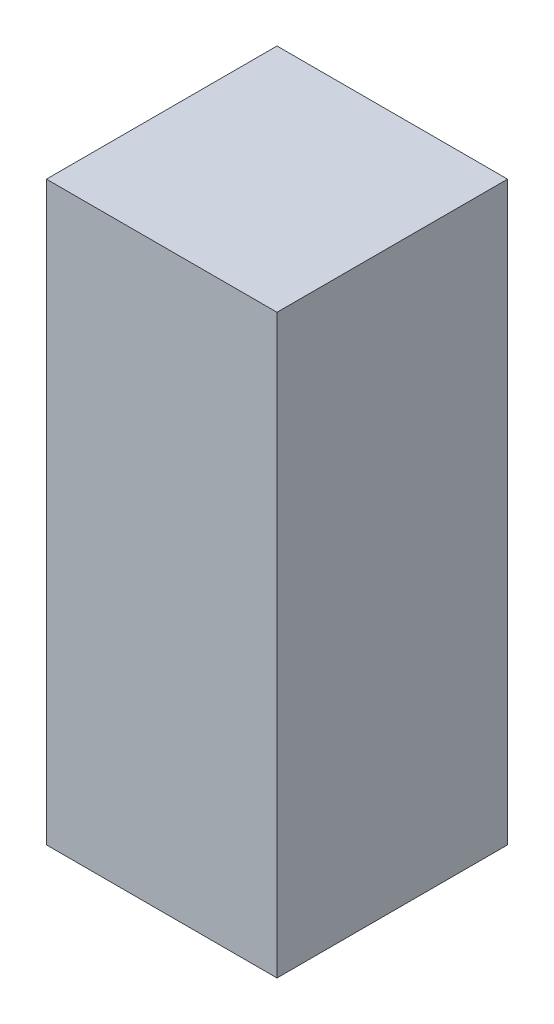
ISO-10303-21;
HEADER;
FILE_DESCRIPTION(('STEP AP214'),'2;1');
FILE_NAME('part.step','',(''),(''),'','','');
FILE_SCHEMA(('AUTOMOTIVE_DESIGN { 1 0 10303 214 1 1 1 1 }'));
ENDSEC;
DATA;
#1=APPLICATION_CONTEXT('core data for automotive mechanical design processes');
#2=APPLICATION_PROTOCOL_DEFINITION('international standard','automotive_design',2000,#1);
#3=PRODUCT_CONTEXT('',#1,'mechanical');
#4=PRODUCT('Part','Part','',(#3));
#5=PRODUCT_RELATED_PRODUCT_CATEGORY('part','',(#4));
#6=PRODUCT_DEFINITION_FORMATION('','',#4);
#7=PRODUCT_DEFINITION_CONTEXT('part definition',#1,'design');
#8=PRODUCT_DEFINITION('design','',#6,#7);
#9=PRODUCT_DEFINITION_SHAPE('','',#8);
#10=(LENGTH_UNIT() NAMED_UNIT(*) SI_UNIT(.MILLI.,.METRE.));
#11=(NAMED_UNIT(*) PLANE_ANGLE_UNIT() SI_UNIT($,.RADIAN.));
#12=(NAMED_UNIT(*) SI_UNIT($,.STERADIAN.) SOLID_ANGLE_UNIT());
#13=UNCERTAINTY_MEASURE_WITH_UNIT(LENGTH_MEASURE(1.E-05),#10,'distance_accuracy_value','');
#14=(GEOMETRIC_REPRESENTATION_CONTEXT(3) GLOBAL_UNCERTAINTY_ASSIGNED_CONTEXT((#13)) GLOBAL_UNIT_ASSIGNED_CONTEXT((#10,
#11,#12)) REPRESENTATION_CONTEXT('',''));
#15=CARTESIAN_POINT('',(0.,0.,0.));
#16=DIRECTION('',(0.,0.,1.));
#17=DIRECTION('',(1.,0.,0.));
#18=AXIS2_PLACEMENT_3D('',#15,#16,#17);
#19=CARTESIAN_POINT('',(0.2499995,0.6250559,0.));
#20=DIRECTION('',(1.,0.,0.));
#21=DIRECTION('',(0.,0.,-1.));
#22=AXIS2_PLACEMENT_3D('',#19,#20,#21);
#23=PLANE('',#22);
#24=DIRECTION('',(0.,0.,-1.));
#25=VECTOR('',#24,1.);
#26=CARTESIAN_POINT('',(0.2499995,-0.62505336,0.));
#27=LINE('',#26,#25);
#28=CARTESIAN_POINT('',(0.2499995,-0.62505336,0.));
#29=VERTEX_POINT('',#28);
#30=CARTESIAN_POINT('',(0.2499995,-0.62505336,0.499999));
#31=VERTEX_POINT('',#30);
#32=EDGE_CURVE('E20',#29,#31,#27,.F.);
#33=ORIENTED_EDGE('',*,*,#32,.F.);
#34=DIRECTION('',(0.,1.,0.));
#35=VECTOR('',#34,1.);
#36=CARTESIAN_POINT('',(0.2499995,-0.62505336,0.));
#37=LINE('',#36,#35);
#38=CARTESIAN_POINT('',(0.2499995,0.6250559,0.));
#39=VERTEX_POINT('',#38);
#40=EDGE_CURVE('E79',#29,#39,#37,.T.);
#41=ORIENTED_EDGE('',*,*,#40,.T.);
#42=DIRECTION('',(0.,0.,1.));
#43=VECTOR('',#42,1.);
#44=CARTESIAN_POINT('',(0.2499995,0.6250559,0.));
#45=LINE('',#44,#43);
#46=CARTESIAN_POINT('',(0.2499995,0.6250559,0.499999));
#47=VERTEX_POINT('',#46);
#48=EDGE_CURVE('E61',#47,#39,#45,.F.);
#49=ORIENTED_EDGE('',*,*,#48,.F.);
#50=DIRECTION('',(0.,1.,0.));
#51=VECTOR('',#50,1.);
#52=CARTESIAN_POINT('',(0.2499995,-0.62505336,0.499999));
#53=LINE('',#52,#51);
#54=EDGE_CURVE('E56',#31,#47,#53,.T.);
#55=ORIENTED_EDGE('',*,*,#54,.F.);
#56=EDGE_LOOP('',(#33,#41,#49,#55));
#57=FACE_BOUND('',#56,.T.);
#58=ADVANCED_FACE('F17',(#57),#23,.T.);
#59=CARTESIAN_POINT('',(0.2499995,-0.62505336,0.));
#60=DIRECTION('',(0.,-1.,0.));
#61=DIRECTION('',(0.,0.,-1.));
#62=AXIS2_PLACEMENT_3D('',#59,#60,#61);
#63=PLANE('',#62);
#64=DIRECTION('',(0.,0.,1.));
#65=VECTOR('',#64,1.);
#66=CARTESIAN_POINT('',(-0.2499995,-0.62505336,0.));
#67=LINE('',#66,#65);
#68=CARTESIAN_POINT('',(-0.2499995,-0.62505336,0.));
#69=VERTEX_POINT('',#68);
#70=CARTESIAN_POINT('',(-0.2499995,-0.62505336,0.499999));
#71=VERTEX_POINT('',#70);
#72=EDGE_CURVE('E83',#69,#71,#67,.T.);
#73=ORIENTED_EDGE('',*,*,#72,.F.);
#74=DIRECTION('',(1.,0.,0.));
#75=VECTOR('',#74,1.);
#76=CARTESIAN_POINT('',(0.2499995,-0.62505336,0.));
#77=LINE('',#76,#75);
#78=EDGE_CURVE('E68',#69,#29,#77,.T.);
#79=ORIENTED_EDGE('',*,*,#78,.T.);
#80=ORIENTED_EDGE('',*,*,#32,.T.);
#81=DIRECTION('',(1.,0.,0.));
#82=VECTOR('',#81,1.);
#83=CARTESIAN_POINT('',(0.2499995,-0.62505336,0.499999));
#84=LINE('',#83,#82);
#85=EDGE_CURVE('E63',#71,#31,#84,.T.);
#86=ORIENTED_EDGE('',*,*,#85,.F.);
#87=EDGE_LOOP('',(#73,#79,#80,#86));
#88=FACE_BOUND('',#87,.T.);
#89=ADVANCED_FACE('F65',(#88),#63,.T.);
#90=CARTESIAN_POINT('',(0.2499995,-0.62505336,0.499999));
#91=DIRECTION('',(0.,0.,1.));
#92=DIRECTION('',(1.,0.,0.));
#93=AXIS2_PLACEMENT_3D('',#90,#91,#92);
#94=PLANE('',#93);
#95=DIRECTION('',(0.,1.,0.));
#96=VECTOR('',#95,1.);
#97=CARTESIAN_POINT('',(-0.2499995,-0.62505336,0.499999));
#98=LINE('',#97,#96);
#99=CARTESIAN_POINT('',(-0.2499995,0.6250559,0.499999));
#100=VERTEX_POINT('',#99);
#101=EDGE_CURVE('E72',#71,#100,#98,.T.);
#102=ORIENTED_EDGE('',*,*,#101,.F.);
#103=ORIENTED_EDGE('',*,*,#85,.T.);
#104=ORIENTED_EDGE('',*,*,#54,.T.);
#105=DIRECTION('',(1.,0.,0.));
#106=VECTOR('',#105,1.);
#107=CARTESIAN_POINT('',(-0.2499995,0.6250559,0.499999));
#108=LINE('',#107,#106);
#109=EDGE_CURVE('E74',#100,#47,#108,.T.);
#110=ORIENTED_EDGE('',*,*,#109,.F.);
#111=EDGE_LOOP('',(#102,#103,#104,#110));
#112=FACE_BOUND('',#111,.T.);
#113=ADVANCED_FACE('F70',(#112),#94,.T.);
#114=CARTESIAN_POINT('',(-0.2499995,0.6250559,0.));
#115=DIRECTION('',(0.,1.,0.));
#116=DIRECTION('',(0.,0.,1.));
#117=AXIS2_PLACEMENT_3D('',#114,#115,#116);
#118=PLANE('',#117);
#119=ORIENTED_EDGE('',*,*,#48,.T.);
#120=DIRECTION('',(1.,0.,0.));
#121=VECTOR('',#120,1.);
#122=CARTESIAN_POINT('',(0.2499995,0.6250559,0.));
#123=LINE('',#122,#121);
#124=CARTESIAN_POINT('',(-0.2499995,0.6250559,0.));
#125=VERTEX_POINT('',#124);
#126=EDGE_CURVE('E35',#39,#125,#123,.F.);
#127=ORIENTED_EDGE('',*,*,#126,.T.);
#128=DIRECTION('',(0.,0.,1.));
#129=VECTOR('',#128,1.);
#130=CARTESIAN_POINT('',(-0.2499995,0.6250559,0.));
#131=LINE('',#130,#129);
#132=EDGE_CURVE('E26',#100,#125,#131,.F.);
#133=ORIENTED_EDGE('',*,*,#132,.F.);
#134=ORIENTED_EDGE('',*,*,#109,.T.);
#135=EDGE_LOOP('',(#119,#127,#133,#134));
#136=FACE_BOUND('',#135,.T.);
#137=ADVANCED_FACE('F89',(#136),#118,.T.);
#138=CARTESIAN_POINT('',(0.2499995,-0.62505336,0.));
#139=DIRECTION('',(0.,0.,1.));
#140=DIRECTION('',(1.,0.,0.));
#141=AXIS2_PLACEMENT_3D('',#138,#139,#140);
#142=PLANE('',#141);
#143=DIRECTION('',(0.,1.,0.));
#144=VECTOR('',#143,1.);
#145=CARTESIAN_POINT('',(-0.2499995,-0.62505336,0.));
#146=LINE('',#145,#144);
#147=EDGE_CURVE('E11',#125,#69,#146,.F.);
#148=ORIENTED_EDGE('',*,*,#147,.F.);
#149=ORIENTED_EDGE('',*,*,#126,.F.);
#150=ORIENTED_EDGE('',*,*,#40,.F.);
#151=ORIENTED_EDGE('',*,*,#78,.F.);
#152=EDGE_LOOP('',(#148,#149,#150,#151));
#153=FACE_BOUND('',#152,.T.);
#154=ADVANCED_FACE('F91',(#153),#142,.F.);
#155=CARTESIAN_POINT('',(-0.2499995,-0.62505336,0.));
#156=DIRECTION('',(-1.,0.,0.));
#157=DIRECTION('',(0.,0.,1.));
#158=AXIS2_PLACEMENT_3D('',#155,#156,#157);
#159=PLANE('',#158);
#160=ORIENTED_EDGE('',*,*,#132,.T.);
#161=ORIENTED_EDGE('',*,*,#147,.T.);
#162=ORIENTED_EDGE('',*,*,#72,.T.);
#163=ORIENTED_EDGE('',*,*,#101,.T.);
#164=EDGE_LOOP('',(#160,#161,#162,#163));
#165=FACE_BOUND('',#164,.T.);
#166=ADVANCED_FACE('F88',(#165),#159,.T.);
#167=CLOSED_SHELL('',(#58,#89,#113,#137,#154,#166));
#168=MANIFOLD_SOLID_BREP('B1',#167);
#169=ADVANCED_BREP_SHAPE_REPRESENTATION('',(#18,#168),#14);
#170=SHAPE_DEFINITION_REPRESENTATION(#9,#169);
ENDSEC;
END-ISO-10303-21;
